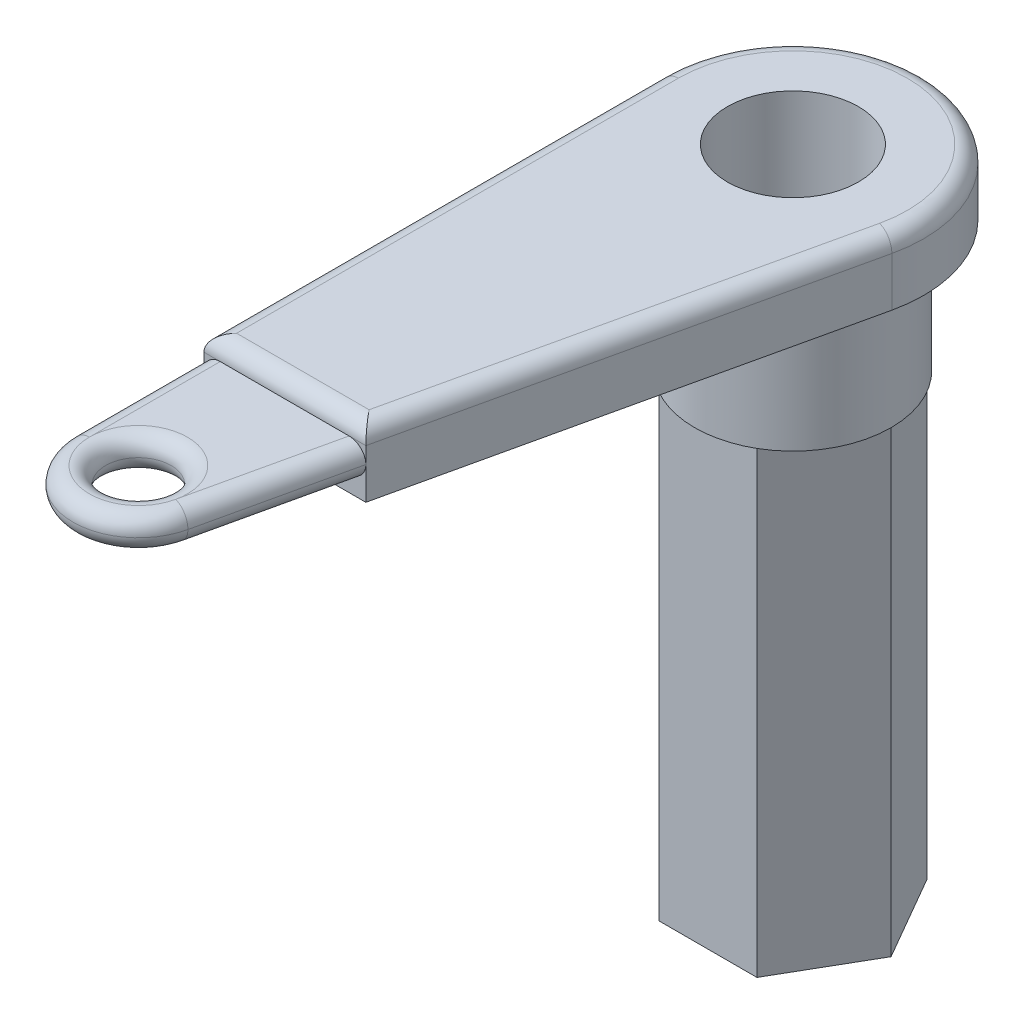
ISO-10303-21;
HEADER;
FILE_DESCRIPTION(('STEP AP214'),'2;1');
FILE_NAME('part.step','',(''),(''),'','','');
FILE_SCHEMA(('AUTOMOTIVE_DESIGN { 1 0 10303 214 1 1 1 1 }'));
ENDSEC;
DATA;
#1=APPLICATION_CONTEXT('core data for automotive mechanical design processes');
#2=APPLICATION_PROTOCOL_DEFINITION('international standard','automotive_design',2000,#1);
#3=PRODUCT_CONTEXT('',#1,'mechanical');
#4=PRODUCT('Part','Part','',(#3));
#5=PRODUCT_RELATED_PRODUCT_CATEGORY('part','',(#4));
#6=PRODUCT_DEFINITION_FORMATION('','',#4);
#7=PRODUCT_DEFINITION_CONTEXT('part definition',#1,'design');
#8=PRODUCT_DEFINITION('design','',#6,#7);
#9=PRODUCT_DEFINITION_SHAPE('','',#8);
#10=(LENGTH_UNIT() NAMED_UNIT(*) SI_UNIT(.MILLI.,.METRE.));
#11=(NAMED_UNIT(*) PLANE_ANGLE_UNIT() SI_UNIT($,.RADIAN.));
#12=(NAMED_UNIT(*) SI_UNIT($,.STERADIAN.) SOLID_ANGLE_UNIT());
#13=UNCERTAINTY_MEASURE_WITH_UNIT(LENGTH_MEASURE(1.E-05),#10,'distance_accuracy_value','');
#14=(GEOMETRIC_REPRESENTATION_CONTEXT(3) GLOBAL_UNCERTAINTY_ASSIGNED_CONTEXT((#13)) GLOBAL_UNIT_ASSIGNED_CONTEXT((#10,
#11,#12)) REPRESENTATION_CONTEXT('',''));
#15=CARTESIAN_POINT('',(0.,0.,0.));
#16=DIRECTION('',(0.,0.,1.));
#17=DIRECTION('',(1.,0.,0.));
#18=AXIS2_PLACEMENT_3D('',#15,#16,#17);
#19=CARTESIAN_POINT('',(0.,-20.,0.));
#20=DIRECTION('',(0.,-1.,0.));
#21=DIRECTION('',(0.,0.,-1.));
#22=AXIS2_PLACEMENT_3D('',#19,#20,#21);
#23=PLANE('',#22);
#24=DIRECTION('',(-0.499999999999995,0.,-0.866025403784441));
#25=VECTOR('',#24,1.);
#26=CARTESIAN_POINT('',(-7.50000000000015,-20.,12.9903810567665));
#27=LINE('',#26,#25);
#28=CARTESIAN_POINT('',(-7.50000000000015,-20.,12.9903810567665));
#29=VERTEX_POINT('',#28);
#30=CARTESIAN_POINT('',(-15.,-20.,0.));
#31=VERTEX_POINT('',#30);
#32=EDGE_CURVE('E55',#29,#31,#27,.T.);
#33=ORIENTED_EDGE('',*,*,#32,.F.);
#34=CARTESIAN_POINT('',(0.,-20.,0.));
#35=DIRECTION('',(0.,-1.,0.));
#36=DIRECTION('',(0.,0.,-1.));
#37=AXIS2_PLACEMENT_3D('',#34,#35,#36);
#38=CIRCLE('',#37,15.);
#39=EDGE_CURVE('E485',#29,#31,#38,.T.);
#40=ORIENTED_EDGE('',*,*,#39,.T.);
#41=EDGE_LOOP('',(#33,#40));
#42=FACE_BOUND('',#41,.T.);
#43=ADVANCED_FACE('F34',(#42),#23,.T.);
#44=DIRECTION('',(-1.,0.,0.));
#45=VECTOR('',#44,1.);
#46=CARTESIAN_POINT('',(7.49999999999988,-20.,12.9903810567666));
#47=LINE('',#46,#45);
#48=CARTESIAN_POINT('',(7.49999999999988,-20.,12.9903810567666));
#49=VERTEX_POINT('',#48);
#50=EDGE_CURVE('E183',#49,#29,#47,.T.);
#51=ORIENTED_EDGE('',*,*,#50,.F.);
#52=EDGE_CURVE('E481',#49,#29,#38,.T.);
#53=ORIENTED_EDGE('',*,*,#52,.T.);
#54=EDGE_LOOP('',(#51,#53));
#55=FACE_BOUND('',#54,.T.);
#56=ADVANCED_FACE('F404',(#55),#23,.T.);
#57=DIRECTION('',(-0.500000000000007,0.,0.866025403784435));
#58=VECTOR('',#57,1.);
#59=CARTESIAN_POINT('',(15.,-20.,1.04744440165294E-13));
#60=LINE('',#59,#58);
#61=CARTESIAN_POINT('',(15.,-20.,1.04083408558608E-13));
#62=VERTEX_POINT('',#61);
#63=EDGE_CURVE('E459',#62,#49,#60,.T.);
#64=ORIENTED_EDGE('',*,*,#63,.F.);
#65=EDGE_CURVE('E198',#62,#49,#38,.T.);
#66=ORIENTED_EDGE('',*,*,#65,.T.);
#67=EDGE_LOOP('',(#64,#66));
#68=FACE_BOUND('',#67,.T.);
#69=ADVANCED_FACE('F410',(#68),#23,.T.);
#70=DIRECTION('',(0.499999999999995,0.,0.866025403784442));
#71=VECTOR('',#70,1.);
#72=CARTESIAN_POINT('',(7.50000000000006,-20.,-12.9903810567665));
#73=LINE('',#72,#71);
#74=CARTESIAN_POINT('',(7.50000000000006,-20.,-12.9903810567665));
#75=VERTEX_POINT('',#74);
#76=EDGE_CURVE('E442',#75,#62,#73,.T.);
#77=ORIENTED_EDGE('',*,*,#76,.F.);
#78=EDGE_CURVE('E191',#75,#62,#38,.T.);
#79=ORIENTED_EDGE('',*,*,#78,.T.);
#80=EDGE_LOOP('',(#77,#79));
#81=FACE_BOUND('',#80,.T.);
#82=ADVANCED_FACE('F426',(#81),#23,.T.);
#83=DIRECTION('',(1.,0.,0.));
#84=VECTOR('',#83,1.);
#85=CARTESIAN_POINT('',(-7.49999999999997,-20.,-12.9903810567666));
#86=LINE('',#85,#84);
#87=CARTESIAN_POINT('',(-7.49999999999997,-20.,-12.9903810567666));
#88=VERTEX_POINT('',#87);
#89=EDGE_CURVE('E436',#88,#75,#86,.T.);
#90=ORIENTED_EDGE('',*,*,#89,.F.);
#91=EDGE_CURVE('E186',#88,#75,#38,.T.);
#92=ORIENTED_EDGE('',*,*,#91,.T.);
#93=EDGE_LOOP('',(#90,#92));
#94=FACE_BOUND('',#93,.T.);
#95=ADVANCED_FACE('F417',(#94),#23,.T.);
#96=CARTESIAN_POINT('',(-9.99999999999999,0.,90.));
#97=DIRECTION('',(0.,1.,0.));
#98=DIRECTION('',(0.,0.,1.));
#99=AXIS2_PLACEMENT_3D('',#96,#97,#98);
#100=PLANE('',#99);
#101=DIRECTION('',(0.219512195121951,0.,-0.975609756097561));
#102=VECTOR('',#101,1.);
#103=CARTESIAN_POINT('',(19.5121951219512,0.,4.39024390243902));
#104=LINE('',#103,#102);
#105=CARTESIAN_POINT('',(4.75,0.,70.));
#106=VERTEX_POINT('',#105);
#107=CARTESIAN_POINT('',(19.5121951219512,0.,4.39024390243902));
#108=VERTEX_POINT('',#107);
#109=EDGE_CURVE('E221',#106,#108,#104,.T.);
#110=ORIENTED_EDGE('',*,*,#109,.F.);
#111=DIRECTION('',(-1.,0.,0.));
#112=VECTOR('',#111,1.);
#113=CARTESIAN_POINT('',(10.,0.,70.));
#114=LINE('',#113,#112);
#115=CARTESIAN_POINT('',(-20.,0.,70.));
#116=VERTEX_POINT('',#115);
#117=EDGE_CURVE('E202',#106,#116,#114,.T.);
#118=ORIENTED_EDGE('',*,*,#117,.T.);
#119=DIRECTION('',(0.,0.,1.));
#120=VECTOR('',#119,1.);
#121=CARTESIAN_POINT('',(-20.,0.,0.));
#122=LINE('',#121,#120);
#123=CARTESIAN_POINT('',(-20.,0.,0.));
#124=VERTEX_POINT('',#123);
#125=EDGE_CURVE('E227',#124,#116,#122,.T.);
#126=ORIENTED_EDGE('',*,*,#125,.F.);
#127=CARTESIAN_POINT('',(0.,0.,0.));
#128=DIRECTION('',(0.,1.,0.));
#129=DIRECTION('',(0.,0.,1.));
#130=AXIS2_PLACEMENT_3D('',#127,#128,#129);
#131=CIRCLE('',#130,20.);
#132=EDGE_CURVE('E224',#108,#124,#131,.T.);
#133=ORIENTED_EDGE('',*,*,#132,.F.);
#134=EDGE_LOOP('',(#110,#118,#126,#133));
#135=FACE_BOUND('',#134,.T.);
#136=CARTESIAN_POINT('',(0.,0.,0.));
#137=DIRECTION('',(0.,1.,0.));
#138=DIRECTION('',(0.,0.,1.));
#139=AXIS2_PLACEMENT_3D('',#136,#137,#138);
#140=CIRCLE('',#139,15.);
#141=CARTESIAN_POINT('',(0.,0.,15.));
#142=VERTEX_POINT('',#141);
#143=EDGE_CURVE('E11',#142,#142,#140,.F.);
#144=ORIENTED_EDGE('',*,*,#143,.F.);
#145=EDGE_LOOP('',(#144));
#146=FACE_BOUND('',#145,.T.);
#147=ADVANCED_FACE('F339',(#135,#146),#100,.F.);
#148=CARTESIAN_POINT('',(10.,10.,70.));
#149=DIRECTION('',(0.,0.,-1.));
#150=DIRECTION('',(-1.,0.,0.));
#151=AXIS2_PLACEMENT_3D('',#148,#149,#150);
#152=PLANE('',#151);
#153=DIRECTION('',(0.,-1.,0.));
#154=VECTOR('',#153,1.);
#155=CARTESIAN_POINT('',(4.75,10.,70.));
#156=LINE('',#155,#154);
#157=CARTESIAN_POINT('',(4.75,7.5,70.));
#158=VERTEX_POINT('',#157);
#159=CARTESIAN_POINT('',(4.75,5.,70.));
#160=VERTEX_POINT('',#159);
#161=EDGE_CURVE('E216',#158,#160,#156,.T.);
#162=ORIENTED_EDGE('',*,*,#161,.F.);
#163=DIRECTION('',(-1.,0.,0.));
#164=VECTOR('',#163,1.);
#165=CARTESIAN_POINT('',(-20.,7.5,70.));
#166=LINE('',#165,#164);
#167=CARTESIAN_POINT('',(2.18750000000001,7.5,70.));
#168=VERTEX_POINT('',#167);
#169=EDGE_CURVE('E42',#158,#168,#166,.T.);
#170=ORIENTED_EDGE('',*,*,#169,.T.);
#171=CARTESIAN_POINT('',(2.18750000000001,5.,70.));
#172=DIRECTION('',(0.,0.,-1.));
#173=DIRECTION('',(-1.,0.,0.));
#174=AXIS2_PLACEMENT_3D('',#171,#172,#173);
#175=ELLIPSE('',#174,2.5625,2.5);
#176=EDGE_CURVE('E255',#168,#160,#175,.T.);
#177=ORIENTED_EDGE('',*,*,#176,.T.);
#178=EDGE_LOOP('',(#162,#170,#177));
#179=FACE_BOUND('',#178,.T.);
#180=ADVANCED_FACE('F381',(#179),#152,.F.);
#181=CARTESIAN_POINT('',(-9.99999999999999,10.,90.));
#182=DIRECTION('',(0.,1.,0.));
#183=DIRECTION('',(0.,0.,1.));
#184=AXIS2_PLACEMENT_3D('',#181,#182,#183);
#185=PLANE('',#184);
#186=DIRECTION('',(-1.,0.,0.));
#187=VECTOR('',#186,1.);
#188=CARTESIAN_POINT('',(4.75,10.,67.5));
#189=LINE('',#188,#187);
#190=CARTESIAN_POINT('',(-17.5,10.,67.5));
#191=VERTEX_POINT('',#190);
#192=CARTESIAN_POINT('',(2.75000000000001,10.,67.5));
#193=VERTEX_POINT('',#192);
#194=EDGE_CURVE('E260',#191,#193,#189,.F.);
#195=ORIENTED_EDGE('',*,*,#194,.T.);
#196=DIRECTION('',(0.219512195121951,0.,-0.975609756097561));
#197=VECTOR('',#196,1.);
#198=CARTESIAN_POINT('',(17.0731707317073,10.,3.84146341463412));
#199=LINE('',#198,#197);
#200=CARTESIAN_POINT('',(17.0731707317073,10.,3.84146341463414));
#201=VERTEX_POINT('',#200);
#202=EDGE_CURVE('E296',#193,#201,#199,.T.);
#203=ORIENTED_EDGE('',*,*,#202,.T.);
#204=CARTESIAN_POINT('',(0.,10.,0.));
#205=DIRECTION('',(0.,1.,0.));
#206=DIRECTION('',(0.,0.,1.));
#207=AXIS2_PLACEMENT_3D('',#204,#205,#206);
#208=CIRCLE('',#207,17.5);
#209=CARTESIAN_POINT('',(-17.5,10.,0.));
#210=VERTEX_POINT('',#209);
#211=EDGE_CURVE('E294',#201,#210,#208,.T.);
#212=ORIENTED_EDGE('',*,*,#211,.T.);
#213=DIRECTION('',(0.,0.,1.));
#214=VECTOR('',#213,1.);
#215=CARTESIAN_POINT('',(-17.5,10.,70.));
#216=LINE('',#215,#214);
#217=EDGE_CURVE('E292',#210,#191,#216,.T.);
#218=ORIENTED_EDGE('',*,*,#217,.T.);
#219=EDGE_LOOP('',(#195,#203,#212,#218));
#220=FACE_BOUND('',#219,.T.);
#221=CARTESIAN_POINT('',(0.,10.,0.));
#222=DIRECTION('',(0.,1.,0.));
#223=DIRECTION('',(0.,0.,1.));
#224=AXIS2_PLACEMENT_3D('',#221,#222,#223);
#225=CIRCLE('',#224,10.);
#226=CARTESIAN_POINT('',(0.,10.,10.));
#227=VERTEX_POINT('',#226);
#228=EDGE_CURVE('E218',#227,#227,#225,.T.);
#229=ORIENTED_EDGE('',*,*,#228,.F.);
#230=EDGE_LOOP('',(#229));
#231=FACE_BOUND('',#230,.T.);
#232=ADVANCED_FACE('F627',(#220,#231),#185,.T.);
#233=CARTESIAN_POINT('',(19.5121951219512,10.,4.39024390243902));
#234=DIRECTION('',(-0.975609756097561,0.,-0.219512195121951));
#235=DIRECTION('',(-0.219512195121951,0.,0.975609756097561));
#236=AXIS2_PLACEMENT_3D('',#233,#234,#235);
#237=PLANE('',#236);
#238=DIRECTION('',(0.,-1.,0.));
#239=VECTOR('',#238,1.);
#240=CARTESIAN_POINT('',(19.5121951219512,10.,4.39024390243902));
#241=LINE('',#240,#239);
#242=CARTESIAN_POINT('',(19.5121951219512,7.5,4.39024390243902));
#243=VERTEX_POINT('',#242);
#244=EDGE_CURVE('E232',#243,#108,#241,.T.);
#245=ORIENTED_EDGE('',*,*,#244,.F.);
#246=DIRECTION('',(0.219512195121951,0.,-0.975609756097561));
#247=VECTOR('',#246,1.);
#248=CARTESIAN_POINT('',(4.75,7.5,70.));
#249=LINE('',#248,#247);
#250=EDGE_CURVE('E299',#243,#158,#249,.F.);
#251=ORIENTED_EDGE('',*,*,#250,.T.);
#252=ORIENTED_EDGE('',*,*,#161,.T.);
#253=DIRECTION('',(0.,-1.,0.));
#254=VECTOR('',#253,1.);
#255=CARTESIAN_POINT('',(4.75,10.,70.));
#256=LINE('',#255,#254);
#257=EDGE_CURVE('E205',#160,#106,#256,.T.);
#258=ORIENTED_EDGE('',*,*,#257,.T.);
#259=ORIENTED_EDGE('',*,*,#109,.T.);
#260=EDGE_LOOP('',(#245,#251,#252,#258,#259));
#261=FACE_BOUND('',#260,.T.);
#262=ADVANCED_FACE('F378',(#261),#237,.F.);
#263=CARTESIAN_POINT('',(0.,10.,0.));
#264=DIRECTION('',(0.,-1.,0.));
#265=DIRECTION('',(0.,0.,-1.));
#266=AXIS2_PLACEMENT_3D('',#263,#264,#265);
#267=CYLINDRICAL_SURFACE('',#266,20.);
#268=DIRECTION('',(0.,-1.,0.));
#269=VECTOR('',#268,1.);
#270=CARTESIAN_POINT('',(-20.,10.,0.));
#271=LINE('',#270,#269);
#272=CARTESIAN_POINT('',(-20.,7.5,0.));
#273=VERTEX_POINT('',#272);
#274=EDGE_CURVE('E230',#273,#124,#271,.T.);
#275=ORIENTED_EDGE('',*,*,#274,.F.);
#276=CARTESIAN_POINT('',(0.,7.5,0.));
#277=DIRECTION('',(0.,1.,0.));
#278=DIRECTION('',(0.,0.,1.));
#279=AXIS2_PLACEMENT_3D('',#276,#277,#278);
#280=CIRCLE('',#279,20.);
#281=EDGE_CURVE('E302',#273,#243,#280,.F.);
#282=ORIENTED_EDGE('',*,*,#281,.T.);
#283=ORIENTED_EDGE('',*,*,#244,.T.);
#284=ORIENTED_EDGE('',*,*,#132,.T.);
#285=EDGE_LOOP('',(#275,#282,#283,#284));
#286=FACE_BOUND('',#285,.T.);
#287=ADVANCED_FACE('F333',(#286),#267,.T.);
#288=CARTESIAN_POINT('',(-20.,10.,0.));
#289=DIRECTION('',(1.,0.,0.));
#290=DIRECTION('',(0.,0.,-1.));
#291=AXIS2_PLACEMENT_3D('',#288,#289,#290);
#292=PLANE('',#291);
#293=DIRECTION('',(0.,-1.,0.));
#294=VECTOR('',#293,1.);
#295=CARTESIAN_POINT('',(-20.,10.,70.));
#296=LINE('',#295,#294);
#297=CARTESIAN_POINT('',(-20.,7.5,70.));
#298=VERTEX_POINT('',#297);
#299=CARTESIAN_POINT('',(-20.,5.,70.));
#300=VERTEX_POINT('',#299);
#301=EDGE_CURVE('E199',#298,#300,#296,.T.);
#302=ORIENTED_EDGE('',*,*,#301,.F.);
#303=DIRECTION('',(0.,0.,1.));
#304=VECTOR('',#303,1.);
#305=CARTESIAN_POINT('',(-20.,7.5,0.));
#306=LINE('',#305,#304);
#307=EDGE_CURVE('E304',#298,#273,#306,.F.);
#308=ORIENTED_EDGE('',*,*,#307,.T.);
#309=ORIENTED_EDGE('',*,*,#274,.T.);
#310=ORIENTED_EDGE('',*,*,#125,.T.);
#311=DIRECTION('',(0.,-1.,0.));
#312=VECTOR('',#311,1.);
#313=CARTESIAN_POINT('',(-20.,0.,70.));
#314=LINE('',#313,#312);
#315=EDGE_CURVE('E206',#300,#116,#314,.T.);
#316=ORIENTED_EDGE('',*,*,#315,.F.);
#317=EDGE_LOOP('',(#302,#308,#309,#310,#316));
#318=FACE_BOUND('',#317,.T.);
#319=ADVANCED_FACE('F330',(#318),#292,.F.);
#320=CARTESIAN_POINT('',(0.,10.,0.));
#321=DIRECTION('',(0.,-1.,0.));
#322=DIRECTION('',(0.,0.,-1.));
#323=AXIS2_PLACEMENT_3D('',#320,#321,#322);
#324=CYLINDRICAL_SURFACE('',#323,10.);
#325=ORIENTED_EDGE('',*,*,#228,.T.);
#326=EDGE_LOOP('',(#325));
#327=FACE_BOUND('',#326,.T.);
#328=CARTESIAN_POINT('',(0.,-90.,0.));
#329=DIRECTION('',(0.,-1.,0.));
#330=DIRECTION('',(0.,0.,-1.));
#331=AXIS2_PLACEMENT_3D('',#328,#329,#330);
#332=CIRCLE('',#331,10.);
#333=CARTESIAN_POINT('',(0.,-90.,-10.));
#334=VERTEX_POINT('',#333);
#335=EDGE_CURVE('E455',#334,#334,#332,.T.);
#336=ORIENTED_EDGE('',*,*,#335,.T.);
#337=EDGE_LOOP('',(#336));
#338=FACE_BOUND('',#337,.T.);
#339=ADVANCED_FACE('F506',(#327,#338),#324,.F.);
#340=CARTESIAN_POINT('',(10.,0.,70.));
#341=DIRECTION('',(0.,0.,-1.));
#342=DIRECTION('',(-1.,0.,0.));
#343=AXIS2_PLACEMENT_3D('',#340,#341,#342);
#344=PLANE('',#343);
#345=ORIENTED_EDGE('',*,*,#257,.F.);
#346=CARTESIAN_POINT('',(2.18750000000001,5.,70.));
#347=DIRECTION('',(0.,0.,-1.));
#348=DIRECTION('',(1.,0.,0.));
#349=AXIS2_PLACEMENT_3D('',#346,#347,#348);
#350=ELLIPSE('',#349,2.5625,2.5);
#351=CARTESIAN_POINT('',(2.18750000000001,2.5,70.));
#352=VERTEX_POINT('',#351);
#353=EDGE_CURVE('E253',#160,#352,#350,.T.);
#354=ORIENTED_EDGE('',*,*,#353,.T.);
#355=DIRECTION('',(-1.,0.,0.));
#356=VECTOR('',#355,1.);
#357=CARTESIAN_POINT('',(10.,2.5,70.));
#358=LINE('',#357,#356);
#359=CARTESIAN_POINT('',(-17.5,2.5,70.));
#360=VERTEX_POINT('',#359);
#361=EDGE_CURVE('E208',#352,#360,#358,.T.);
#362=ORIENTED_EDGE('',*,*,#361,.T.);
#363=CARTESIAN_POINT('',(-17.5,5.,70.));
#364=DIRECTION('',(0.,0.,-1.));
#365=DIRECTION('',(-1.,0.,0.));
#366=AXIS2_PLACEMENT_3D('',#363,#364,#365);
#367=CIRCLE('',#366,2.5);
#368=EDGE_CURVE('E250',#360,#300,#367,.T.);
#369=ORIENTED_EDGE('',*,*,#368,.T.);
#370=ORIENTED_EDGE('',*,*,#315,.T.);
#371=ORIENTED_EDGE('',*,*,#117,.F.);
#372=EDGE_LOOP('',(#345,#354,#362,#369,#370,#371));
#373=FACE_BOUND('',#372,.T.);
#374=ADVANCED_FACE('F344',(#373),#344,.F.);
#375=CARTESIAN_POINT('',(10.,2.5,100.));
#376=DIRECTION('',(0.,1.,0.));
#377=DIRECTION('',(0.,0.,1.));
#378=AXIS2_PLACEMENT_3D('',#375,#376,#377);
#379=PLANE('',#378);
#380=CARTESIAN_POINT('',(-9.99999999999999,2.5,90.));
#381=DIRECTION('',(0.,1.,0.));
#382=DIRECTION('',(0.,0.,1.));
#383=AXIS2_PLACEMENT_3D('',#380,#381,#382);
#384=CIRCLE('',#383,7.5);
#385=CARTESIAN_POINT('',(-2.68292682926828,2.5,91.6463414634146));
#386=VERTEX_POINT('',#385);
#387=CARTESIAN_POINT('',(-17.5,2.5,90.));
#388=VERTEX_POINT('',#387);
#389=EDGE_CURVE('E234',#386,#388,#384,.T.);
#390=ORIENTED_EDGE('',*,*,#389,.T.);
#391=DIRECTION('',(0.,0.,-1.));
#392=VECTOR('',#391,1.);
#393=CARTESIAN_POINT('',(-17.5,2.5,100.));
#394=LINE('',#393,#392);
#395=EDGE_CURVE('E238',#388,#360,#394,.T.);
#396=ORIENTED_EDGE('',*,*,#395,.T.);
#397=ORIENTED_EDGE('',*,*,#361,.F.);
#398=DIRECTION('',(0.219512195121951,0.,-0.975609756097561));
#399=VECTOR('',#398,1.);
#400=CARTESIAN_POINT('',(-3.8607971445568,2.5,96.8813206424747));
#401=LINE('',#400,#399);
#402=EDGE_CURVE('E236',#352,#386,#401,.F.);
#403=ORIENTED_EDGE('',*,*,#402,.T.);
#404=EDGE_LOOP('',(#390,#396,#397,#403));
#405=FACE_BOUND('',#404,.T.);
#406=ADVANCED_FACE('F390',(#405),#379,.F.);
#407=CARTESIAN_POINT('',(-17.5,5.,70.));
#408=DIRECTION('',(0.,0.,-1.));
#409=DIRECTION('',(-1.,0.,0.));
#410=AXIS2_PLACEMENT_3D('',#407,#408,#409);
#411=CIRCLE('',#410,2.5);
#412=CARTESIAN_POINT('',(-17.5,7.5,70.));
#413=VERTEX_POINT('',#412);
#414=EDGE_CURVE('E258',#300,#413,#411,.T.);
#415=ORIENTED_EDGE('',*,*,#414,.T.);
#416=DIRECTION('',(-1.,0.,0.));
#417=VECTOR('',#416,1.);
#418=CARTESIAN_POINT('',(-20.,7.5,70.));
#419=LINE('',#418,#417);
#420=EDGE_CURVE('E306',#413,#298,#419,.T.);
#421=ORIENTED_EDGE('',*,*,#420,.T.);
#422=ORIENTED_EDGE('',*,*,#301,.T.);
#423=EDGE_LOOP('',(#415,#421,#422));
#424=FACE_BOUND('',#423,.T.);
#425=ADVANCED_FACE('F629',(#424),#152,.F.);
#426=CARTESIAN_POINT('',(10.,7.5,100.));
#427=DIRECTION('',(0.,-1.,0.));
#428=DIRECTION('',(0.,0.,-1.));
#429=AXIS2_PLACEMENT_3D('',#426,#427,#428);
#430=PLANE('',#429);
#431=CARTESIAN_POINT('',(-9.99999999999999,7.5,90.));
#432=DIRECTION('',(0.,-1.,0.));
#433=DIRECTION('',(0.,0.,-1.));
#434=AXIS2_PLACEMENT_3D('',#431,#432,#433);
#435=CIRCLE('',#434,7.5);
#436=CARTESIAN_POINT('',(-9.99999999999999,7.5,82.5));
#437=VERTEX_POINT('',#436);
#438=CARTESIAN_POINT('',(-2.68292682926828,7.5,91.6463414634146));
#439=VERTEX_POINT('',#438);
#440=EDGE_CURVE('E243',#437,#439,#435,.T.);
#441=ORIENTED_EDGE('',*,*,#440,.T.);
#442=DIRECTION('',(-0.219512195121951,0.,0.975609756097561));
#443=VECTOR('',#442,1.);
#444=CARTESIAN_POINT('',(-3.8607971445568,7.5,96.8813206424747));
#445=LINE('',#444,#443);
#446=EDGE_CURVE('E247',#439,#168,#445,.F.);
#447=ORIENTED_EDGE('',*,*,#446,.T.);
#448=DIRECTION('',(-1.,0.,0.));
#449=VECTOR('',#448,1.);
#450=CARTESIAN_POINT('',(10.,7.5,70.));
#451=LINE('',#450,#449);
#452=EDGE_CURVE('E201',#168,#413,#451,.T.);
#453=ORIENTED_EDGE('',*,*,#452,.T.);
#454=DIRECTION('',(0.,0.,1.));
#455=VECTOR('',#454,1.);
#456=CARTESIAN_POINT('',(-17.5,7.5,100.));
#457=LINE('',#456,#455);
#458=CARTESIAN_POINT('',(-17.5,7.5,90.));
#459=VERTEX_POINT('',#458);
#460=EDGE_CURVE('E245',#413,#459,#457,.T.);
#461=ORIENTED_EDGE('',*,*,#460,.T.);
#462=CARTESIAN_POINT('',(-9.99999999999999,7.5,90.));
#463=DIRECTION('',(0.,-1.,0.));
#464=DIRECTION('',(0.,0.,-1.));
#465=AXIS2_PLACEMENT_3D('',#462,#463,#464);
#466=CIRCLE('',#465,7.5);
#467=EDGE_CURVE('E241',#459,#437,#466,.T.);
#468=ORIENTED_EDGE('',*,*,#467,.T.);
#469=EDGE_LOOP('',(#441,#447,#453,#461,#468));
#470=FACE_BOUND('',#469,.T.);
#471=ADVANCED_FACE('F369',(#470),#430,.F.);
#472=CARTESIAN_POINT('',(17.0731707317073,4.99999999999999,3.84146341463414));
#473=DIRECTION('',(-0.219512195121951,0.,0.975609756097561));
#474=DIRECTION('',(0.975609756097561,0.,0.219512195121951));
#475=AXIS2_PLACEMENT_3D('',#472,#473,#474);
#476=CYLINDRICAL_SURFACE('',#475,2.5);
#477=ORIENTED_EDGE('',*,*,#176,.F.);
#478=ORIENTED_EDGE('',*,*,#446,.F.);
#479=CARTESIAN_POINT('',(-2.68292682926829,5.,91.6463414634146));
#480=DIRECTION('',(-0.219512195121951,0.,0.975609756097561));
#481=DIRECTION('',(0.975609756097561,0.,0.219512195121951));
#482=AXIS2_PLACEMENT_3D('',#479,#480,#481);
#483=CIRCLE('',#482,2.5);
#484=CARTESIAN_POINT('',(-0.243902439024382,5.,92.1951219512195));
#485=VERTEX_POINT('',#484);
#486=EDGE_CURVE('E286',#485,#439,#483,.T.);
#487=ORIENTED_EDGE('',*,*,#486,.F.);
#488=DIRECTION('',(-0.219512195121951,0.,0.975609756097561));
#489=VECTOR('',#488,1.);
#490=CARTESIAN_POINT('',(19.5121951219512,4.99999999999999,4.39024390243902));
#491=LINE('',#490,#489);
#492=EDGE_CURVE('E283',#160,#485,#491,.T.);
#493=ORIENTED_EDGE('',*,*,#492,.F.);
#494=EDGE_LOOP('',(#477,#478,#487,#493));
#495=FACE_BOUND('',#494,.T.);
#496=ADVANCED_FACE('F385',(#495),#476,.T.);
#497=CARTESIAN_POINT('',(-9.99999999999999,5.,90.));
#498=DIRECTION('',(0.,-1.,0.));
#499=DIRECTION('',(0.,0.,-1.));
#500=AXIS2_PLACEMENT_3D('',#497,#498,#499);
#501=TOROIDAL_SURFACE('',#500,7.5,2.5);
#502=CARTESIAN_POINT('',(-9.99999999999999,7.5,90.));
#503=DIRECTION('',(0.,-1.,0.));
#504=DIRECTION('',(0.,0.,-1.));
#505=AXIS2_PLACEMENT_3D('',#502,#503,#504);
#506=CIRCLE('',#505,7.5);
#507=EDGE_CURVE('E209',#439,#459,#506,.T.);
#508=ORIENTED_EDGE('',*,*,#507,.F.);
#509=ORIENTED_EDGE('',*,*,#440,.F.);
#510=ORIENTED_EDGE('',*,*,#467,.F.);
#511=EDGE_LOOP('',(#508,#509,#510));
#512=FACE_BOUND('',#511,.T.);
#513=CARTESIAN_POINT('',(-9.99999999999999,5.,90.));
#514=DIRECTION('',(0.,-1.,0.));
#515=DIRECTION('',(0.,0.,-1.));
#516=AXIS2_PLACEMENT_3D('',#513,#514,#515);
#517=CIRCLE('',#516,5.);
#518=CARTESIAN_POINT('',(-9.99999999999999,5.,85.));
#519=VERTEX_POINT('',#518);
#520=EDGE_CURVE('E280',#519,#519,#517,.F.);
#521=ORIENTED_EDGE('',*,*,#520,.F.);
#522=EDGE_LOOP('',(#521));
#523=FACE_BOUND('',#522,.T.);
#524=ADVANCED_FACE('F366',(#512,#523),#501,.T.);
#525=CARTESIAN_POINT('',(-9.99999999999999,5.,90.));
#526=DIRECTION('',(0.,-1.,0.));
#527=DIRECTION('',(0.,0.,-1.));
#528=AXIS2_PLACEMENT_3D('',#525,#526,#527);
#529=TOROIDAL_SURFACE('',#528,7.5,2.5);
#530=ORIENTED_EDGE('',*,*,#486,.T.);
#531=ORIENTED_EDGE('',*,*,#507,.T.);
#532=CARTESIAN_POINT('',(-17.5,5.,90.));
#533=DIRECTION('',(0.,0.,-1.));
#534=DIRECTION('',(-1.,0.,0.));
#535=AXIS2_PLACEMENT_3D('',#532,#533,#534);
#536=CIRCLE('',#535,2.5);
#537=CARTESIAN_POINT('',(-20.,5.,90.));
#538=VERTEX_POINT('',#537);
#539=EDGE_CURVE('E277',#538,#459,#536,.T.);
#540=ORIENTED_EDGE('',*,*,#539,.F.);
#541=CARTESIAN_POINT('',(-9.99999999999999,5.,90.));
#542=DIRECTION('',(0.,-1.,0.));
#543=DIRECTION('',(0.,0.,-1.));
#544=AXIS2_PLACEMENT_3D('',#541,#542,#543);
#545=CIRCLE('',#544,10.);
#546=EDGE_CURVE('E274',#485,#538,#545,.T.);
#547=ORIENTED_EDGE('',*,*,#546,.F.);
#548=EDGE_LOOP('',(#530,#531,#540,#547));
#549=FACE_BOUND('',#548,.T.);
#550=ADVANCED_FACE('F361',(#549),#529,.T.);
#551=CARTESIAN_POINT('',(17.0731707317073,5.00000000000001,3.84146341463414));
#552=DIRECTION('',(0.219512195121951,0.,-0.975609756097561));
#553=DIRECTION('',(-0.975609756097561,0.,-0.219512195121951));
#554=AXIS2_PLACEMENT_3D('',#551,#552,#553);
#555=CYLINDRICAL_SURFACE('',#554,2.5);
#556=ORIENTED_EDGE('',*,*,#353,.F.);
#557=ORIENTED_EDGE('',*,*,#492,.T.);
#558=CARTESIAN_POINT('',(-2.68292682926829,5.,91.6463414634146));
#559=DIRECTION('',(-0.219512195121951,0.,0.975609756097561));
#560=DIRECTION('',(0.975609756097561,0.,0.219512195121951));
#561=AXIS2_PLACEMENT_3D('',#558,#559,#560);
#562=CIRCLE('',#561,2.5);
#563=EDGE_CURVE('E271',#386,#485,#562,.T.);
#564=ORIENTED_EDGE('',*,*,#563,.F.);
#565=ORIENTED_EDGE('',*,*,#402,.F.);
#566=EDGE_LOOP('',(#556,#557,#564,#565));
#567=FACE_BOUND('',#566,.T.);
#568=ADVANCED_FACE('F388',(#567),#555,.T.);
#569=CARTESIAN_POINT('',(-9.99999999999999,5.,90.));
#570=DIRECTION('',(0.,1.,0.));
#571=DIRECTION('',(0.,0.,1.));
#572=AXIS2_PLACEMENT_3D('',#569,#570,#571);
#573=TOROIDAL_SURFACE('',#572,7.5,2.5);
#574=ORIENTED_EDGE('',*,*,#520,.T.);
#575=EDGE_LOOP('',(#574));
#576=FACE_BOUND('',#575,.T.);
#577=CARTESIAN_POINT('',(-9.99999999999999,2.5,90.));
#578=DIRECTION('',(0.,1.,0.));
#579=DIRECTION('',(0.,0.,1.));
#580=AXIS2_PLACEMENT_3D('',#577,#578,#579);
#581=CIRCLE('',#580,7.5);
#582=EDGE_CURVE('E268',#388,#386,#581,.T.);
#583=ORIENTED_EDGE('',*,*,#582,.F.);
#584=ORIENTED_EDGE('',*,*,#389,.F.);
#585=EDGE_LOOP('',(#583,#584));
#586=FACE_BOUND('',#585,.T.);
#587=ADVANCED_FACE('F393',(#576,#586),#573,.T.);
#588=CARTESIAN_POINT('',(-17.5,5.,100.));
#589=DIRECTION('',(0.,0.,1.));
#590=DIRECTION('',(1.,0.,0.));
#591=AXIS2_PLACEMENT_3D('',#588,#589,#590);
#592=CYLINDRICAL_SURFACE('',#591,2.5);
#593=ORIENTED_EDGE('',*,*,#460,.F.);
#594=ORIENTED_EDGE('',*,*,#414,.F.);
#595=DIRECTION('',(0.,0.,1.));
#596=VECTOR('',#595,1.);
#597=CARTESIAN_POINT('',(-20.,4.99999999999999,0.));
#598=LINE('',#597,#596);
#599=EDGE_CURVE('E264',#538,#300,#598,.F.);
#600=ORIENTED_EDGE('',*,*,#599,.F.);
#601=ORIENTED_EDGE('',*,*,#539,.T.);
#602=EDGE_LOOP('',(#593,#594,#600,#601));
#603=FACE_BOUND('',#602,.T.);
#604=ADVANCED_FACE('F351',(#603),#592,.T.);
#605=CARTESIAN_POINT('',(-9.99999999999999,5.,90.));
#606=DIRECTION('',(0.,1.,0.));
#607=DIRECTION('',(0.,0.,1.));
#608=AXIS2_PLACEMENT_3D('',#605,#606,#607);
#609=TOROIDAL_SURFACE('',#608,7.5,2.5);
#610=ORIENTED_EDGE('',*,*,#563,.T.);
#611=ORIENTED_EDGE('',*,*,#546,.T.);
#612=CARTESIAN_POINT('',(-17.5,5.,90.));
#613=DIRECTION('',(0.,0.,-1.));
#614=DIRECTION('',(-1.,0.,0.));
#615=AXIS2_PLACEMENT_3D('',#612,#613,#614);
#616=CIRCLE('',#615,2.5);
#617=EDGE_CURVE('E261',#388,#538,#616,.T.);
#618=ORIENTED_EDGE('',*,*,#617,.F.);
#619=ORIENTED_EDGE('',*,*,#582,.T.);
#620=EDGE_LOOP('',(#610,#611,#618,#619));
#621=FACE_BOUND('',#620,.T.);
#622=ADVANCED_FACE('F356',(#621),#609,.T.);
#623=CARTESIAN_POINT('',(-17.5,5.,100.));
#624=DIRECTION('',(0.,0.,-1.));
#625=DIRECTION('',(-1.,0.,0.));
#626=AXIS2_PLACEMENT_3D('',#623,#624,#625);
#627=CYLINDRICAL_SURFACE('',#626,2.5);
#628=ORIENTED_EDGE('',*,*,#617,.T.);
#629=ORIENTED_EDGE('',*,*,#599,.T.);
#630=ORIENTED_EDGE('',*,*,#368,.F.);
#631=ORIENTED_EDGE('',*,*,#395,.F.);
#632=EDGE_LOOP('',(#628,#629,#630,#631));
#633=FACE_BOUND('',#632,.T.);
#634=ADVANCED_FACE('F353',(#633),#627,.T.);
#635=CARTESIAN_POINT('',(-17.5,7.5,90.));
#636=DIRECTION('',(0.,0.,-1.));
#637=DIRECTION('',(-1.,0.,0.));
#638=AXIS2_PLACEMENT_3D('',#635,#636,#637);
#639=CYLINDRICAL_SURFACE('',#638,2.5);
#640=CARTESIAN_POINT('',(-17.5,7.5,0.));
#641=DIRECTION('',(0.,0.,-1.));
#642=DIRECTION('',(0.,1.,0.));
#643=AXIS2_PLACEMENT_3D('',#640,#641,#642);
#644=CIRCLE('',#643,2.5);
#645=EDGE_CURVE('E312',#273,#210,#644,.T.);
#646=ORIENTED_EDGE('',*,*,#645,.F.);
#647=ORIENTED_EDGE('',*,*,#307,.F.);
#648=CARTESIAN_POINT('',(-17.5,7.5,67.5));
#649=DIRECTION('',(0.707106781186548,0.,0.707106781186547));
#650=DIRECTION('',(0.707106781186547,0.,-0.707106781186548));
#651=AXIS2_PLACEMENT_3D('',#648,#649,#650);
#652=ELLIPSE('',#651,3.53553390593274,2.5);
#653=EDGE_CURVE('E265',#191,#298,#652,.T.);
#654=ORIENTED_EDGE('',*,*,#653,.F.);
#655=ORIENTED_EDGE('',*,*,#217,.F.);
#656=EDGE_LOOP('',(#646,#647,#654,#655));
#657=FACE_BOUND('',#656,.T.);
#658=ADVANCED_FACE('F36',(#657),#639,.T.);
#659=CARTESIAN_POINT('',(10.,7.5,67.5));
#660=DIRECTION('',(1.,0.,0.));
#661=DIRECTION('',(0.,0.,-1.));
#662=AXIS2_PLACEMENT_3D('',#659,#660,#661);
#663=CYLINDRICAL_SURFACE('',#662,2.5);
#664=ORIENTED_EDGE('',*,*,#452,.F.);
#665=ORIENTED_EDGE('',*,*,#169,.F.);
#666=CARTESIAN_POINT('',(2.75000000000001,7.5,67.5));
#667=DIRECTION('',(0.78086880944303,0.,-0.624695047554424));
#668=DIRECTION('',(0.624695047554424,0.,0.78086880944303));
#669=AXIS2_PLACEMENT_3D('',#666,#667,#668);
#670=ELLIPSE('',#669,3.20156211871642,2.5);
#671=EDGE_CURVE('E310',#193,#158,#670,.T.);
#672=ORIENTED_EDGE('',*,*,#671,.F.);
#673=ORIENTED_EDGE('',*,*,#194,.F.);
#674=ORIENTED_EDGE('',*,*,#653,.T.);
#675=ORIENTED_EDGE('',*,*,#420,.F.);
#676=EDGE_LOOP('',(#664,#665,#672,#673,#674,#675));
#677=FACE_BOUND('',#676,.T.);
#678=ADVANCED_FACE('F320',(#677),#663,.T.);
#679=CARTESIAN_POINT('',(0.,7.5,0.));
#680=DIRECTION('',(0.,1.,0.));
#681=DIRECTION('',(0.,0.,1.));
#682=AXIS2_PLACEMENT_3D('',#679,#680,#681);
#683=TOROIDAL_SURFACE('',#682,17.5,2.5);
#684=ORIENTED_EDGE('',*,*,#645,.T.);
#685=ORIENTED_EDGE('',*,*,#211,.F.);
#686=CARTESIAN_POINT('',(17.0731707317073,7.5,3.84146341463414));
#687=DIRECTION('',(-0.219512195121951,0.,0.975609756097561));
#688=DIRECTION('',(0.975609756097561,0.,0.219512195121951));
#689=AXIS2_PLACEMENT_3D('',#686,#687,#688);
#690=CIRCLE('',#689,2.5);
#691=EDGE_CURVE('E197',#243,#201,#690,.T.);
#692=ORIENTED_EDGE('',*,*,#691,.F.);
#693=ORIENTED_EDGE('',*,*,#281,.F.);
#694=EDGE_LOOP('',(#684,#685,#692,#693));
#695=FACE_BOUND('',#694,.T.);
#696=ADVANCED_FACE('F423',(#695),#683,.T.);
#697=CARTESIAN_POINT('',(-2.68292682926829,7.5,91.6463414634146));
#698=DIRECTION('',(-0.219512195121951,0.,0.975609756097561));
#699=DIRECTION('',(0.975609756097561,0.,0.219512195121951));
#700=AXIS2_PLACEMENT_3D('',#697,#698,#699);
#701=CYLINDRICAL_SURFACE('',#700,2.5);
#702=ORIENTED_EDGE('',*,*,#671,.T.);
#703=ORIENTED_EDGE('',*,*,#250,.F.);
#704=ORIENTED_EDGE('',*,*,#691,.T.);
#705=ORIENTED_EDGE('',*,*,#202,.F.);
#706=EDGE_LOOP('',(#702,#703,#704,#705));
#707=FACE_BOUND('',#706,.T.);
#708=ADVANCED_FACE('F416',(#707),#701,.T.);
#709=DIRECTION('',(0.500000000000001,0.,-0.866025403784438));
#710=VECTOR('',#709,1.);
#711=CARTESIAN_POINT('',(-15.,-20.,0.));
#712=LINE('',#711,#710);
#713=EDGE_CURVE('E48',#31,#88,#712,.T.);
#714=ORIENTED_EDGE('',*,*,#713,.F.);
#715=EDGE_CURVE('E189',#31,#88,#38,.T.);
#716=ORIENTED_EDGE('',*,*,#715,.T.);
#717=EDGE_LOOP('',(#714,#716));
#718=FACE_BOUND('',#717,.T.);
#719=ADVANCED_FACE('F406',(#718),#23,.T.);
#720=CARTESIAN_POINT('',(0.,-20.,0.));
#721=DIRECTION('',(0.,1.,0.));
#722=DIRECTION('',(0.,0.,1.));
#723=AXIS2_PLACEMENT_3D('',#720,#721,#722);
#724=CYLINDRICAL_SURFACE('',#723,15.);
#725=ORIENTED_EDGE('',*,*,#78,.F.);
#726=ORIENTED_EDGE('',*,*,#91,.F.);
#727=ORIENTED_EDGE('',*,*,#715,.F.);
#728=ORIENTED_EDGE('',*,*,#39,.F.);
#729=ORIENTED_EDGE('',*,*,#52,.F.);
#730=ORIENTED_EDGE('',*,*,#65,.F.);
#731=EDGE_LOOP('',(#725,#726,#727,#728,#729,#730));
#732=FACE_BOUND('',#731,.T.);
#733=ORIENTED_EDGE('',*,*,#143,.T.);
#734=EDGE_LOOP('',(#733));
#735=FACE_BOUND('',#734,.T.);
#736=ADVANCED_FACE('F415',(#732,#735),#724,.T.);
#737=CARTESIAN_POINT('',(0.,-90.,0.));
#738=DIRECTION('',(0.,-1.,0.));
#739=DIRECTION('',(0.,0.,-1.));
#740=AXIS2_PLACEMENT_3D('',#737,#738,#739);
#741=PLANE('',#740);
#742=DIRECTION('',(-0.499999999999995,0.,-0.866025403784441));
#743=VECTOR('',#742,1.);
#744=CARTESIAN_POINT('',(-7.50000000000015,-90.,12.9903810567665));
#745=LINE('',#744,#743);
#746=CARTESIAN_POINT('',(-7.50000000000015,-90.,12.9903810567665));
#747=VERTEX_POINT('',#746);
#748=CARTESIAN_POINT('',(-15.,-90.,0.));
#749=VERTEX_POINT('',#748);
#750=EDGE_CURVE('E173',#747,#749,#745,.T.);
#751=ORIENTED_EDGE('',*,*,#750,.T.);
#752=DIRECTION('',(0.500000000000001,0.,-0.866025403784438));
#753=VECTOR('',#752,1.);
#754=CARTESIAN_POINT('',(-15.,-90.,0.));
#755=LINE('',#754,#753);
#756=CARTESIAN_POINT('',(-7.49999999999997,-90.,-12.9903810567666));
#757=VERTEX_POINT('',#756);
#758=EDGE_CURVE('E163',#749,#757,#755,.T.);
#759=ORIENTED_EDGE('',*,*,#758,.T.);
#760=DIRECTION('',(1.,0.,0.));
#761=VECTOR('',#760,1.);
#762=CARTESIAN_POINT('',(-7.49999999999997,-90.,-12.9903810567666));
#763=LINE('',#762,#761);
#764=CARTESIAN_POINT('',(7.50000000000006,-90.,-12.9903810567665));
#765=VERTEX_POINT('',#764);
#766=EDGE_CURVE('E172',#757,#765,#763,.T.);
#767=ORIENTED_EDGE('',*,*,#766,.T.);
#768=DIRECTION('',(0.499999999999995,0.,0.866025403784442));
#769=VECTOR('',#768,1.);
#770=CARTESIAN_POINT('',(7.50000000000006,-90.,-12.9903810567665));
#771=LINE('',#770,#769);
#772=CARTESIAN_POINT('',(15.,-90.,1.04744440165294E-13));
#773=VERTEX_POINT('',#772);
#774=EDGE_CURVE('E447',#765,#773,#771,.T.);
#775=ORIENTED_EDGE('',*,*,#774,.T.);
#776=DIRECTION('',(-0.500000000000007,0.,0.866025403784435));
#777=VECTOR('',#776,1.);
#778=CARTESIAN_POINT('',(15.,-90.,1.04744440165294E-13));
#779=LINE('',#778,#777);
#780=CARTESIAN_POINT('',(7.49999999999988,-90.,12.9903810567666));
#781=VERTEX_POINT('',#780);
#782=EDGE_CURVE('E449',#773,#781,#779,.T.);
#783=ORIENTED_EDGE('',*,*,#782,.T.);
#784=DIRECTION('',(-1.,0.,0.));
#785=VECTOR('',#784,1.);
#786=CARTESIAN_POINT('',(7.49999999999988,-90.,12.9903810567666));
#787=LINE('',#786,#785);
#788=EDGE_CURVE('E179',#781,#747,#787,.T.);
#789=ORIENTED_EDGE('',*,*,#788,.T.);
#790=EDGE_LOOP('',(#751,#759,#767,#775,#783,#789));
#791=FACE_BOUND('',#790,.T.);
#792=ORIENTED_EDGE('',*,*,#335,.F.);
#793=EDGE_LOOP('',(#792));
#794=FACE_BOUND('',#793,.T.);
#795=ADVANCED_FACE('F176',(#791,#794),#741,.T.);
#796=CARTESIAN_POINT('',(-7.50000000000015,-90.,12.9903810567665));
#797=DIRECTION('',(0.866025403784442,0.,-0.499999999999995));
#798=DIRECTION('',(-0.499999999999995,0.,-0.866025403784442));
#799=AXIS2_PLACEMENT_3D('',#796,#797,#798);
#800=PLANE('',#799);
#801=ORIENTED_EDGE('',*,*,#32,.T.);
#802=DIRECTION('',(0.,1.,0.));
#803=VECTOR('',#802,1.);
#804=CARTESIAN_POINT('',(-15.,-90.,0.));
#805=LINE('',#804,#803);
#806=EDGE_CURVE('E167',#749,#31,#805,.T.);
#807=ORIENTED_EDGE('',*,*,#806,.F.);
#808=ORIENTED_EDGE('',*,*,#750,.F.);
#809=DIRECTION('',(0.,1.,0.));
#810=VECTOR('',#809,1.);
#811=CARTESIAN_POINT('',(-7.50000000000015,-90.,12.9903810567665));
#812=LINE('',#811,#810);
#813=EDGE_CURVE('E454',#747,#29,#812,.T.);
#814=ORIENTED_EDGE('',*,*,#813,.T.);
#815=EDGE_LOOP('',(#801,#807,#808,#814));
#816=FACE_BOUND('',#815,.T.);
#817=ADVANCED_FACE('F185',(#816),#800,.F.);
#818=CARTESIAN_POINT('',(-15.,-90.,0.));
#819=DIRECTION('',(0.866025403784438,0.,0.500000000000001));
#820=DIRECTION('',(0.500000000000001,0.,-0.866025403784438));
#821=AXIS2_PLACEMENT_3D('',#818,#819,#820);
#822=PLANE('',#821);
#823=ORIENTED_EDGE('',*,*,#713,.T.);
#824=DIRECTION('',(0.,1.,0.));
#825=VECTOR('',#824,1.);
#826=CARTESIAN_POINT('',(-7.49999999999997,-90.,-12.9903810567666));
#827=LINE('',#826,#825);
#828=EDGE_CURVE('E169',#757,#88,#827,.T.);
#829=ORIENTED_EDGE('',*,*,#828,.F.);
#830=ORIENTED_EDGE('',*,*,#758,.F.);
#831=ORIENTED_EDGE('',*,*,#806,.T.);
#832=EDGE_LOOP('',(#823,#829,#830,#831));
#833=FACE_BOUND('',#832,.T.);
#834=ADVANCED_FACE('F165',(#833),#822,.F.);
#835=CARTESIAN_POINT('',(-7.49999999999997,-90.,-12.9903810567666));
#836=DIRECTION('',(0.,0.,1.));
#837=DIRECTION('',(1.,0.,0.));
#838=AXIS2_PLACEMENT_3D('',#835,#836,#837);
#839=PLANE('',#838);
#840=ORIENTED_EDGE('',*,*,#89,.T.);
#841=DIRECTION('',(0.,1.,0.));
#842=VECTOR('',#841,1.);
#843=CARTESIAN_POINT('',(7.50000000000006,-90.,-12.9903810567665));
#844=LINE('',#843,#842);
#845=EDGE_CURVE('E192',#765,#75,#844,.T.);
#846=ORIENTED_EDGE('',*,*,#845,.F.);
#847=ORIENTED_EDGE('',*,*,#766,.F.);
#848=ORIENTED_EDGE('',*,*,#828,.T.);
#849=EDGE_LOOP('',(#840,#846,#847,#848));
#850=FACE_BOUND('',#849,.T.);
#851=ADVANCED_FACE('F445',(#850),#839,.F.);
#852=CARTESIAN_POINT('',(7.50000000000006,-90.,-12.9903810567665));
#853=DIRECTION('',(-0.866025403784441,0.,0.499999999999995));
#854=DIRECTION('',(0.499999999999995,0.,0.866025403784442));
#855=AXIS2_PLACEMENT_3D('',#852,#853,#854);
#856=PLANE('',#855);
#857=ORIENTED_EDGE('',*,*,#76,.T.);
#858=DIRECTION('',(0.,1.,0.));
#859=VECTOR('',#858,1.);
#860=CARTESIAN_POINT('',(15.,-90.,1.04744440165294E-13));
#861=LINE('',#860,#859);
#862=EDGE_CURVE('E468',#773,#62,#861,.T.);
#863=ORIENTED_EDGE('',*,*,#862,.F.);
#864=ORIENTED_EDGE('',*,*,#774,.F.);
#865=ORIENTED_EDGE('',*,*,#845,.T.);
#866=EDGE_LOOP('',(#857,#863,#864,#865));
#867=FACE_BOUND('',#866,.T.);
#868=ADVANCED_FACE('F471',(#867),#856,.F.);
#869=CARTESIAN_POINT('',(15.,-90.,1.04744440165294E-13));
#870=DIRECTION('',(-0.866025403784434,0.,-0.500000000000007));
#871=DIRECTION('',(-0.500000000000007,0.,0.866025403784435));
#872=AXIS2_PLACEMENT_3D('',#869,#870,#871);
#873=PLANE('',#872);
#874=ORIENTED_EDGE('',*,*,#63,.T.);
#875=DIRECTION('',(0.,1.,0.));
#876=VECTOR('',#875,1.);
#877=CARTESIAN_POINT('',(7.49999999999988,-90.,12.9903810567666));
#878=LINE('',#877,#876);
#879=EDGE_CURVE('E465',#781,#49,#878,.T.);
#880=ORIENTED_EDGE('',*,*,#879,.F.);
#881=ORIENTED_EDGE('',*,*,#782,.F.);
#882=ORIENTED_EDGE('',*,*,#862,.T.);
#883=EDGE_LOOP('',(#874,#880,#881,#882));
#884=FACE_BOUND('',#883,.T.);
#885=ADVANCED_FACE('F476',(#884),#873,.F.);
#886=CARTESIAN_POINT('',(7.49999999999988,-90.,12.9903810567666));
#887=DIRECTION('',(0.,0.,-1.));
#888=DIRECTION('',(-1.,0.,0.));
#889=AXIS2_PLACEMENT_3D('',#886,#887,#888);
#890=PLANE('',#889);
#891=ORIENTED_EDGE('',*,*,#50,.T.);
#892=ORIENTED_EDGE('',*,*,#813,.F.);
#893=ORIENTED_EDGE('',*,*,#788,.F.);
#894=ORIENTED_EDGE('',*,*,#879,.T.);
#895=EDGE_LOOP('',(#891,#892,#893,#894));
#896=FACE_BOUND('',#895,.T.);
#897=ADVANCED_FACE('F478',(#896),#890,.F.);
#898=CLOSED_SHELL('',(#43,#56,#69,#82,#95,#147,#180,#232,#262,#287,#319,#339,#374,#406,#425,
#471,#496,#524,#550,#568,#587,#604,#622,#634,#658,#678,#696,#708,#719,#736,#795,#817,#834,#851,
#868,#885,#897));
#899=MANIFOLD_SOLID_BREP('B2',#898);
#900=ADVANCED_BREP_SHAPE_REPRESENTATION('',(#18,#899),#14);
#901=SHAPE_DEFINITION_REPRESENTATION(#9,#900);
ENDSEC;
END-ISO-10303-21;
